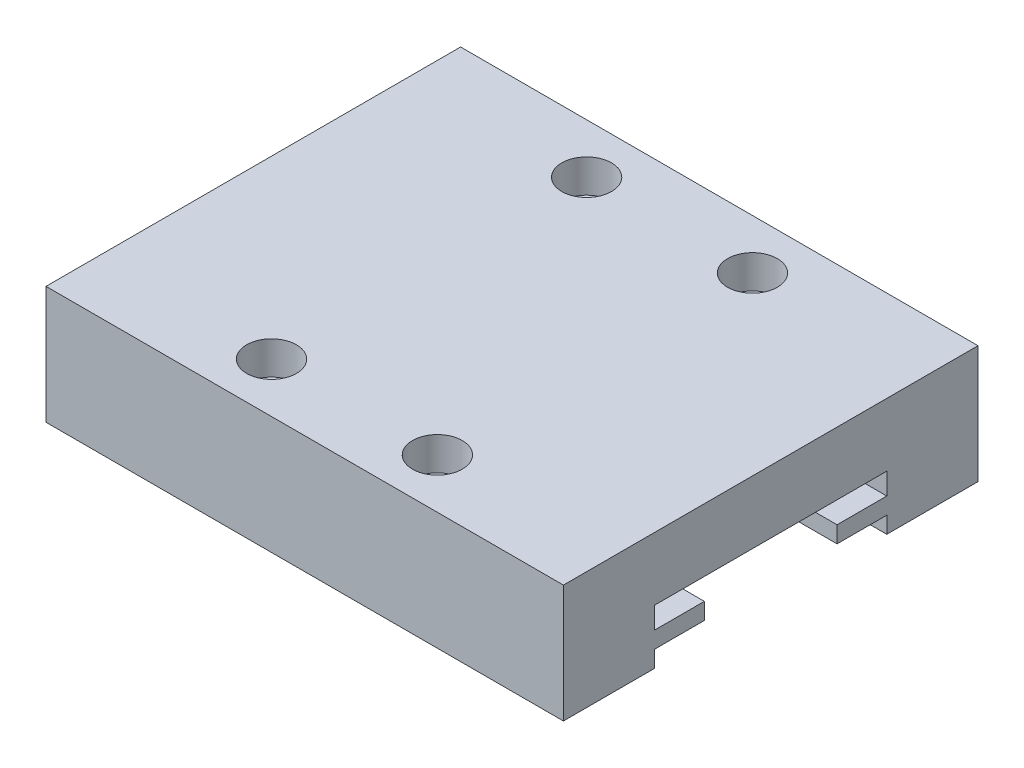
ISO-10303-21;
HEADER;
FILE_DESCRIPTION(('STEP AP214'),'2;1');
FILE_NAME('part.step','',(''),(''),'','','');
FILE_SCHEMA(('AUTOMOTIVE_DESIGN { 1 0 10303 214 1 1 1 1 }'));
ENDSEC;
DATA;
#1=APPLICATION_CONTEXT('core data for automotive mechanical design processes');
#2=APPLICATION_PROTOCOL_DEFINITION('international standard','automotive_design',2000,#1);
#3=PRODUCT_CONTEXT('',#1,'mechanical');
#4=PRODUCT('Part','Part','',(#3));
#5=PRODUCT_RELATED_PRODUCT_CATEGORY('part','',(#4));
#6=PRODUCT_DEFINITION_FORMATION('','',#4);
#7=PRODUCT_DEFINITION_CONTEXT('part definition',#1,'design');
#8=PRODUCT_DEFINITION('design','',#6,#7);
#9=PRODUCT_DEFINITION_SHAPE('','',#8);
#10=(LENGTH_UNIT() NAMED_UNIT(*) SI_UNIT(.MILLI.,.METRE.));
#11=(NAMED_UNIT(*) PLANE_ANGLE_UNIT() SI_UNIT($,.RADIAN.));
#12=(NAMED_UNIT(*) SI_UNIT($,.STERADIAN.) SOLID_ANGLE_UNIT());
#13=UNCERTAINTY_MEASURE_WITH_UNIT(LENGTH_MEASURE(1.E-05),#10,'distance_accuracy_value','');
#14=(GEOMETRIC_REPRESENTATION_CONTEXT(3) GLOBAL_UNCERTAINTY_ASSIGNED_CONTEXT((#13)) GLOBAL_UNIT_ASSIGNED_CONTEXT((#10,
#11,#12)) REPRESENTATION_CONTEXT('',''));
#15=CARTESIAN_POINT('',(0.,0.,0.));
#16=DIRECTION('',(0.,0.,1.));
#17=DIRECTION('',(1.,0.,0.));
#18=AXIS2_PLACEMENT_3D('',#15,#16,#17);
#19=CARTESIAN_POINT('',(0.,0.,0.));
#20=DIRECTION('',(0.,-1.,0.));
#21=DIRECTION('',(0.,0.,-1.));
#22=AXIS2_PLACEMENT_3D('',#19,#20,#21);
#23=PLANE('',#22);
#24=DIRECTION('',(1.,0.,0.));
#25=VECTOR('',#24,1.);
#26=CARTESIAN_POINT('',(0.,0.,-19.5));
#27=LINE('',#26,#25);
#28=CARTESIAN_POINT('',(0.,0.,-19.5));
#29=VERTEX_POINT('',#28);
#30=CARTESIAN_POINT('',(31.2,0.,-19.5));
#31=VERTEX_POINT('',#30);
#32=EDGE_CURVE('E166',#29,#31,#27,.T.);
#33=ORIENTED_EDGE('',*,*,#32,.F.);
#34=DIRECTION('',(0.,0.,1.));
#35=VECTOR('',#34,1.);
#36=CARTESIAN_POINT('',(0.,0.,0.));
#37=LINE('',#36,#35);
#38=CARTESIAN_POINT('',(0.,0.,-25.));
#39=VERTEX_POINT('',#38);
#40=EDGE_CURVE('E181',#39,#29,#37,.T.);
#41=ORIENTED_EDGE('',*,*,#40,.F.);
#42=DIRECTION('',(-1.,0.,0.));
#43=VECTOR('',#42,1.);
#44=CARTESIAN_POINT('',(0.,0.,-25.));
#45=LINE('',#44,#43);
#46=CARTESIAN_POINT('',(31.2,0.,-25.));
#47=VERTEX_POINT('',#46);
#48=EDGE_CURVE('E80',#47,#39,#45,.T.);
#49=ORIENTED_EDGE('',*,*,#48,.F.);
#50=DIRECTION('',(0.,0.,-1.));
#51=VECTOR('',#50,1.);
#52=CARTESIAN_POINT('',(31.2,0.,0.));
#53=LINE('',#52,#51);
#54=EDGE_CURVE('E190',#31,#47,#53,.T.);
#55=ORIENTED_EDGE('',*,*,#54,.F.);
#56=EDGE_LOOP('',(#33,#41,#49,#55));
#57=FACE_BOUND('',#56,.T.);
#58=ADVANCED_FACE('F35',(#57),#23,.T.);
#59=CARTESIAN_POINT('',(0.,7.1,0.));
#60=DIRECTION('',(1.,0.,0.));
#61=DIRECTION('',(0.,0.,-1.));
#62=AXIS2_PLACEMENT_3D('',#59,#60,#61);
#63=PLANE('',#62);
#64=ORIENTED_EDGE('',*,*,#40,.T.);
#65=DIRECTION('',(0.,-1.,0.));
#66=VECTOR('',#65,1.);
#67=CARTESIAN_POINT('',(0.,0.,-19.5));
#68=LINE('',#67,#66);
#69=CARTESIAN_POINT('',(0.,1.,-19.5));
#70=VERTEX_POINT('',#69);
#71=EDGE_CURVE('E260',#70,#29,#68,.T.);
#72=ORIENTED_EDGE('',*,*,#71,.F.);
#73=DIRECTION('',(0.,0.,-1.));
#74=VECTOR('',#73,1.);
#75=CARTESIAN_POINT('',(0.,1.,-19.5));
#76=LINE('',#75,#74);
#77=CARTESIAN_POINT('',(0.,1.,-16.5));
#78=VERTEX_POINT('',#77);
#79=EDGE_CURVE('E307',#78,#70,#76,.T.);
#80=ORIENTED_EDGE('',*,*,#79,.F.);
#81=DIRECTION('',(0.,-1.,0.));
#82=VECTOR('',#81,1.);
#83=CARTESIAN_POINT('',(0.,1.,-16.5));
#84=LINE('',#83,#82);
#85=CARTESIAN_POINT('',(0.,2.,-16.5));
#86=VERTEX_POINT('',#85);
#87=EDGE_CURVE('E305',#86,#78,#84,.T.);
#88=ORIENTED_EDGE('',*,*,#87,.F.);
#89=DIRECTION('',(0.,0.,1.));
#90=VECTOR('',#89,1.);
#91=CARTESIAN_POINT('',(0.,2.,-16.5));
#92=LINE('',#91,#90);
#93=CARTESIAN_POINT('',(0.,2.,-19.5));
#94=VERTEX_POINT('',#93);
#95=EDGE_CURVE('E239',#94,#86,#92,.T.);
#96=ORIENTED_EDGE('',*,*,#95,.F.);
#97=DIRECTION('',(0.,-1.,0.));
#98=VECTOR('',#97,1.);
#99=CARTESIAN_POINT('',(0.,2.,-19.5));
#100=LINE('',#99,#98);
#101=CARTESIAN_POINT('',(0.,3.3,-19.5));
#102=VERTEX_POINT('',#101);
#103=EDGE_CURVE('E302',#102,#94,#100,.T.);
#104=ORIENTED_EDGE('',*,*,#103,.F.);
#105=DIRECTION('',(0.,0.,-1.));
#106=VECTOR('',#105,1.);
#107=CARTESIAN_POINT('',(0.,3.3,-19.5));
#108=LINE('',#107,#106);
#109=CARTESIAN_POINT('',(0.,3.3,-5.50000000000001));
#110=VERTEX_POINT('',#109);
#111=EDGE_CURVE('E297',#110,#102,#108,.T.);
#112=ORIENTED_EDGE('',*,*,#111,.F.);
#113=DIRECTION('',(0.,1.,0.));
#114=VECTOR('',#113,1.);
#115=CARTESIAN_POINT('',(0.,2.,-5.5));
#116=LINE('',#115,#114);
#117=CARTESIAN_POINT('',(0.,2.,-5.5));
#118=VERTEX_POINT('',#117);
#119=EDGE_CURVE('E291',#118,#110,#116,.T.);
#120=ORIENTED_EDGE('',*,*,#119,.F.);
#121=DIRECTION('',(0.,0.,1.));
#122=VECTOR('',#121,1.);
#123=CARTESIAN_POINT('',(0.,2.,-8.5));
#124=LINE('',#123,#122);
#125=CARTESIAN_POINT('',(0.,2.,-8.5));
#126=VERTEX_POINT('',#125);
#127=EDGE_CURVE('E285',#126,#118,#124,.T.);
#128=ORIENTED_EDGE('',*,*,#127,.F.);
#129=DIRECTION('',(0.,1.,0.));
#130=VECTOR('',#129,1.);
#131=CARTESIAN_POINT('',(0.,1.,-8.5));
#132=LINE('',#131,#130);
#133=CARTESIAN_POINT('',(0.,1.,-8.5));
#134=VERTEX_POINT('',#133);
#135=EDGE_CURVE('E279',#134,#126,#132,.T.);
#136=ORIENTED_EDGE('',*,*,#135,.F.);
#137=DIRECTION('',(0.,0.,-1.));
#138=VECTOR('',#137,1.);
#139=CARTESIAN_POINT('',(0.,1.,-5.5));
#140=LINE('',#139,#138);
#141=CARTESIAN_POINT('',(0.,1.,-5.5));
#142=VERTEX_POINT('',#141);
#143=EDGE_CURVE('E176',#142,#134,#140,.T.);
#144=ORIENTED_EDGE('',*,*,#143,.F.);
#145=DIRECTION('',(0.,1.,0.));
#146=VECTOR('',#145,1.);
#147=CARTESIAN_POINT('',(0.,0.,-5.5));
#148=LINE('',#147,#146);
#149=CARTESIAN_POINT('',(0.,0.,-5.5));
#150=VERTEX_POINT('',#149);
#151=EDGE_CURVE('E160',#150,#142,#148,.T.);
#152=ORIENTED_EDGE('',*,*,#151,.F.);
#153=CARTESIAN_POINT('',(0.,0.,0.));
#154=VERTEX_POINT('',#153);
#155=EDGE_CURVE('E172',#150,#154,#37,.T.);
#156=ORIENTED_EDGE('',*,*,#155,.T.);
#157=DIRECTION('',(0.,-1.,0.));
#158=VECTOR('',#157,1.);
#159=CARTESIAN_POINT('',(0.,7.1,0.));
#160=LINE('',#159,#158);
#161=CARTESIAN_POINT('',(0.,7.1,0.));
#162=VERTEX_POINT('',#161);
#163=EDGE_CURVE('E167',#162,#154,#160,.T.);
#164=ORIENTED_EDGE('',*,*,#163,.F.);
#165=DIRECTION('',(0.,0.,1.));
#166=VECTOR('',#165,1.);
#167=CARTESIAN_POINT('',(0.,7.1,0.));
#168=LINE('',#167,#166);
#169=CARTESIAN_POINT('',(0.,7.1,-25.));
#170=VERTEX_POINT('',#169);
#171=EDGE_CURVE('E194',#170,#162,#168,.T.);
#172=ORIENTED_EDGE('',*,*,#171,.F.);
#173=DIRECTION('',(0.,-1.,0.));
#174=VECTOR('',#173,1.);
#175=CARTESIAN_POINT('',(0.,7.1,-25.));
#176=LINE('',#175,#174);
#177=EDGE_CURVE('E195',#170,#39,#176,.T.);
#178=ORIENTED_EDGE('',*,*,#177,.T.);
#179=EDGE_LOOP('',(#64,#72,#80,#88,#96,#104,#112,#120,#128,#136,#144,#152,#156,#164,#172,#178));
#180=FACE_BOUND('',#179,.T.);
#181=ADVANCED_FACE('F37',(#180),#63,.F.);
#182=CARTESIAN_POINT('',(0.,7.1,0.));
#183=DIRECTION('',(0.,0.,-1.));
#184=DIRECTION('',(-1.,0.,0.));
#185=AXIS2_PLACEMENT_3D('',#182,#183,#184);
#186=PLANE('',#185);
#187=DIRECTION('',(1.,0.,0.));
#188=VECTOR('',#187,1.);
#189=CARTESIAN_POINT('',(0.,0.,0.));
#190=LINE('',#189,#188);
#191=CARTESIAN_POINT('',(31.2,0.,0.));
#192=VERTEX_POINT('',#191);
#193=EDGE_CURVE('E180',#154,#192,#190,.T.);
#194=ORIENTED_EDGE('',*,*,#193,.T.);
#195=DIRECTION('',(0.,-1.,0.));
#196=VECTOR('',#195,1.);
#197=CARTESIAN_POINT('',(31.2,7.1,0.));
#198=LINE('',#197,#196);
#199=CARTESIAN_POINT('',(31.2,7.1,0.));
#200=VERTEX_POINT('',#199);
#201=EDGE_CURVE('E199',#200,#192,#198,.T.);
#202=ORIENTED_EDGE('',*,*,#201,.F.);
#203=DIRECTION('',(1.,0.,0.));
#204=VECTOR('',#203,1.);
#205=CARTESIAN_POINT('',(0.,7.1,0.));
#206=LINE('',#205,#204);
#207=EDGE_CURVE('E88',#162,#200,#206,.T.);
#208=ORIENTED_EDGE('',*,*,#207,.F.);
#209=ORIENTED_EDGE('',*,*,#163,.T.);
#210=EDGE_LOOP('',(#194,#202,#208,#209));
#211=FACE_BOUND('',#210,.T.);
#212=ADVANCED_FACE('F271',(#211),#186,.F.);
#213=CARTESIAN_POINT('',(31.2,7.1,0.));
#214=DIRECTION('',(-1.,0.,0.));
#215=DIRECTION('',(0.,0.,1.));
#216=AXIS2_PLACEMENT_3D('',#213,#214,#215);
#217=PLANE('',#216);
#218=DIRECTION('',(0.,0.,-1.));
#219=VECTOR('',#218,1.);
#220=CARTESIAN_POINT('',(31.2,1.,0.));
#221=LINE('',#220,#219);
#222=CARTESIAN_POINT('',(31.2,1.,-16.5));
#223=VERTEX_POINT('',#222);
#224=CARTESIAN_POINT('',(31.2,1.,-19.5));
#225=VERTEX_POINT('',#224);
#226=EDGE_CURVE('E11',#223,#225,#221,.T.);
#227=ORIENTED_EDGE('',*,*,#226,.T.);
#228=DIRECTION('',(0.,-1.,0.));
#229=VECTOR('',#228,1.);
#230=CARTESIAN_POINT('',(31.2,7.1,-19.5));
#231=LINE('',#230,#229);
#232=EDGE_CURVE('E182',#225,#31,#231,.T.);
#233=ORIENTED_EDGE('',*,*,#232,.T.);
#234=ORIENTED_EDGE('',*,*,#54,.T.);
#235=DIRECTION('',(0.,-1.,0.));
#236=VECTOR('',#235,1.);
#237=CARTESIAN_POINT('',(31.2,7.1,-25.));
#238=LINE('',#237,#236);
#239=CARTESIAN_POINT('',(31.2,7.1,-25.));
#240=VERTEX_POINT('',#239);
#241=EDGE_CURVE('E197',#240,#47,#238,.T.);
#242=ORIENTED_EDGE('',*,*,#241,.F.);
#243=DIRECTION('',(0.,0.,-1.));
#244=VECTOR('',#243,1.);
#245=CARTESIAN_POINT('',(31.2,7.1,0.));
#246=LINE('',#245,#244);
#247=EDGE_CURVE('E263',#200,#240,#246,.T.);
#248=ORIENTED_EDGE('',*,*,#247,.F.);
#249=ORIENTED_EDGE('',*,*,#201,.T.);
#250=CARTESIAN_POINT('',(31.2,0.,-5.5));
#251=VERTEX_POINT('',#250);
#252=EDGE_CURVE('E191',#192,#251,#53,.T.);
#253=ORIENTED_EDGE('',*,*,#252,.T.);
#254=DIRECTION('',(0.,1.,0.));
#255=VECTOR('',#254,1.);
#256=CARTESIAN_POINT('',(31.2,7.1,-5.5));
#257=LINE('',#256,#255);
#258=CARTESIAN_POINT('',(31.2,1.,-5.5));
#259=VERTEX_POINT('',#258);
#260=EDGE_CURVE('E50',#251,#259,#257,.T.);
#261=ORIENTED_EDGE('',*,*,#260,.T.);
#262=DIRECTION('',(0.,0.,-1.));
#263=VECTOR('',#262,1.);
#264=CARTESIAN_POINT('',(31.2,1.,0.));
#265=LINE('',#264,#263);
#266=CARTESIAN_POINT('',(31.2,1.,-8.5));
#267=VERTEX_POINT('',#266);
#268=EDGE_CURVE('E204',#259,#267,#265,.T.);
#269=ORIENTED_EDGE('',*,*,#268,.T.);
#270=DIRECTION('',(0.,1.,0.));
#271=VECTOR('',#270,1.);
#272=CARTESIAN_POINT('',(31.2,7.1,-8.5));
#273=LINE('',#272,#271);
#274=CARTESIAN_POINT('',(31.2,2.,-8.5));
#275=VERTEX_POINT('',#274);
#276=EDGE_CURVE('E207',#267,#275,#273,.T.);
#277=ORIENTED_EDGE('',*,*,#276,.T.);
#278=DIRECTION('',(0.,0.,1.));
#279=VECTOR('',#278,1.);
#280=CARTESIAN_POINT('',(31.2,2.,0.));
#281=LINE('',#280,#279);
#282=CARTESIAN_POINT('',(31.2,2.,-5.5));
#283=VERTEX_POINT('',#282);
#284=EDGE_CURVE('E210',#275,#283,#281,.T.);
#285=ORIENTED_EDGE('',*,*,#284,.T.);
#286=DIRECTION('',(0.,1.,0.));
#287=VECTOR('',#286,1.);
#288=CARTESIAN_POINT('',(31.2,7.09999999999998,-5.50000000000002));
#289=LINE('',#288,#287);
#290=CARTESIAN_POINT('',(31.2,3.3,-5.50000000000001));
#291=VERTEX_POINT('',#290);
#292=EDGE_CURVE('E213',#283,#291,#289,.T.);
#293=ORIENTED_EDGE('',*,*,#292,.T.);
#294=DIRECTION('',(0.,0.,-1.));
#295=VECTOR('',#294,1.);
#296=CARTESIAN_POINT('',(31.2,3.3,0.));
#297=LINE('',#296,#295);
#298=CARTESIAN_POINT('',(31.2,3.3,-19.5));
#299=VERTEX_POINT('',#298);
#300=EDGE_CURVE('E216',#291,#299,#297,.T.);
#301=ORIENTED_EDGE('',*,*,#300,.T.);
#302=DIRECTION('',(0.,-1.,0.));
#303=VECTOR('',#302,1.);
#304=CARTESIAN_POINT('',(31.2,7.10000000000005,-19.5));
#305=LINE('',#304,#303);
#306=CARTESIAN_POINT('',(31.2,2.,-19.5));
#307=VERTEX_POINT('',#306);
#308=EDGE_CURVE('E219',#299,#307,#305,.T.);
#309=ORIENTED_EDGE('',*,*,#308,.T.);
#310=DIRECTION('',(0.,0.,1.));
#311=VECTOR('',#310,1.);
#312=CARTESIAN_POINT('',(31.2,2.,0.));
#313=LINE('',#312,#311);
#314=CARTESIAN_POINT('',(31.2,2.,-16.5));
#315=VERTEX_POINT('',#314);
#316=EDGE_CURVE('E222',#307,#315,#313,.T.);
#317=ORIENTED_EDGE('',*,*,#316,.T.);
#318=DIRECTION('',(0.,-1.,0.));
#319=VECTOR('',#318,1.);
#320=CARTESIAN_POINT('',(31.2,7.1,-16.5));
#321=LINE('',#320,#319);
#322=EDGE_CURVE('E43',#315,#223,#321,.T.);
#323=ORIENTED_EDGE('',*,*,#322,.T.);
#324=EDGE_LOOP('',(#227,#233,#234,#242,#248,#249,#253,#261,#269,#277,#285,#293,#301,#309,#317,#323));
#325=FACE_BOUND('',#324,.T.);
#326=ADVANCED_FACE('F226',(#325),#217,.F.);
#327=CARTESIAN_POINT('',(0.,7.1,-25.));
#328=DIRECTION('',(0.,0.,1.));
#329=DIRECTION('',(1.,0.,0.));
#330=AXIS2_PLACEMENT_3D('',#327,#328,#329);
#331=PLANE('',#330);
#332=ORIENTED_EDGE('',*,*,#48,.T.);
#333=ORIENTED_EDGE('',*,*,#177,.F.);
#334=DIRECTION('',(-1.,0.,0.));
#335=VECTOR('',#334,1.);
#336=CARTESIAN_POINT('',(0.,7.1,-25.));
#337=LINE('',#336,#335);
#338=EDGE_CURVE('E59',#240,#170,#337,.T.);
#339=ORIENTED_EDGE('',*,*,#338,.F.);
#340=ORIENTED_EDGE('',*,*,#241,.T.);
#341=EDGE_LOOP('',(#332,#333,#339,#340));
#342=FACE_BOUND('',#341,.T.);
#343=ADVANCED_FACE('F268',(#342),#331,.F.);
#344=CARTESIAN_POINT('',(0.,7.1,0.));
#345=DIRECTION('',(0.,-1.,0.));
#346=DIRECTION('',(0.,0.,-1.));
#347=AXIS2_PLACEMENT_3D('',#344,#345,#346);
#348=PLANE('',#347);
#349=CARTESIAN_POINT('',(10.6,7.1,-3.));
#350=DIRECTION('',(0.,1.,0.));
#351=DIRECTION('',(0.,0.,-1.));
#352=AXIS2_PLACEMENT_3D('',#349,#350,#351);
#353=CIRCLE('',#352,1.5);
#354=CARTESIAN_POINT('',(10.6,7.1,-4.5));
#355=VERTEX_POINT('',#354);
#356=EDGE_CURVE('E414',#355,#355,#353,.T.);
#357=ORIENTED_EDGE('',*,*,#356,.F.);
#358=EDGE_LOOP('',(#357));
#359=FACE_BOUND('',#358,.T.);
#360=CARTESIAN_POINT('',(20.6,7.1,-3.));
#361=DIRECTION('',(0.,1.,0.));
#362=DIRECTION('',(0.,0.,1.));
#363=AXIS2_PLACEMENT_3D('',#360,#361,#362);
#364=CIRCLE('',#363,1.5);
#365=CARTESIAN_POINT('',(20.6,7.1,-1.5));
#366=VERTEX_POINT('',#365);
#367=EDGE_CURVE('E408',#366,#366,#364,.T.);
#368=ORIENTED_EDGE('',*,*,#367,.F.);
#369=EDGE_LOOP('',(#368));
#370=FACE_BOUND('',#369,.T.);
#371=CARTESIAN_POINT('',(20.6,7.1,-22.));
#372=DIRECTION('',(0.,1.,0.));
#373=DIRECTION('',(0.,0.,-1.));
#374=AXIS2_PLACEMENT_3D('',#371,#372,#373);
#375=CIRCLE('',#374,1.5);
#376=CARTESIAN_POINT('',(20.6,7.1,-23.5));
#377=VERTEX_POINT('',#376);
#378=EDGE_CURVE('E398',#377,#377,#375,.T.);
#379=ORIENTED_EDGE('',*,*,#378,.F.);
#380=EDGE_LOOP('',(#379));
#381=FACE_BOUND('',#380,.T.);
#382=CARTESIAN_POINT('',(10.6,7.1,-22.));
#383=DIRECTION('',(0.,1.,0.));
#384=DIRECTION('',(0.,0.,1.));
#385=AXIS2_PLACEMENT_3D('',#382,#383,#384);
#386=CIRCLE('',#385,1.5);
#387=CARTESIAN_POINT('',(10.6,7.1,-20.5));
#388=VERTEX_POINT('',#387);
#389=EDGE_CURVE('E397',#388,#388,#386,.T.);
#390=ORIENTED_EDGE('',*,*,#389,.F.);
#391=EDGE_LOOP('',(#390));
#392=FACE_BOUND('',#391,.T.);
#393=ORIENTED_EDGE('',*,*,#171,.T.);
#394=ORIENTED_EDGE('',*,*,#207,.T.);
#395=ORIENTED_EDGE('',*,*,#247,.T.);
#396=ORIENTED_EDGE('',*,*,#338,.T.);
#397=EDGE_LOOP('',(#393,#394,#395,#396));
#398=FACE_BOUND('',#397,.T.);
#399=ADVANCED_FACE('F266',(#359,#370,#381,#392,#398),#348,.F.);
#400=DIRECTION('',(-1.,0.,0.));
#401=VECTOR('',#400,1.);
#402=CARTESIAN_POINT('',(0.,0.,-5.5));
#403=LINE('',#402,#401);
#404=EDGE_CURVE('E157',#251,#150,#403,.T.);
#405=ORIENTED_EDGE('',*,*,#404,.F.);
#406=ORIENTED_EDGE('',*,*,#252,.F.);
#407=ORIENTED_EDGE('',*,*,#193,.F.);
#408=ORIENTED_EDGE('',*,*,#155,.F.);
#409=EDGE_LOOP('',(#405,#406,#407,#408));
#410=FACE_BOUND('',#409,.T.);
#411=ADVANCED_FACE('F179',(#410),#23,.T.);
#412=CARTESIAN_POINT('',(50.9,1.,-19.5));
#413=DIRECTION('',(0.,1.,0.));
#414=DIRECTION('',(0.,0.,1.));
#415=AXIS2_PLACEMENT_3D('',#412,#413,#414);
#416=PLANE('',#415);
#417=DIRECTION('',(-1.,0.,0.));
#418=VECTOR('',#417,1.);
#419=CARTESIAN_POINT('',(50.9,1.,-16.5));
#420=LINE('',#419,#418);
#421=EDGE_CURVE('E234',#223,#78,#420,.T.);
#422=ORIENTED_EDGE('',*,*,#421,.T.);
#423=ORIENTED_EDGE('',*,*,#79,.T.);
#424=DIRECTION('',(-1.,0.,0.));
#425=VECTOR('',#424,1.);
#426=CARTESIAN_POINT('',(50.9,1.,-19.5));
#427=LINE('',#426,#425);
#428=EDGE_CURVE('E243',#225,#70,#427,.T.);
#429=ORIENTED_EDGE('',*,*,#428,.F.);
#430=ORIENTED_EDGE('',*,*,#226,.F.);
#431=EDGE_LOOP('',(#422,#423,#429,#430));
#432=FACE_BOUND('',#431,.T.);
#433=ADVANCED_FACE('F319',(#432),#416,.F.);
#434=CARTESIAN_POINT('',(50.9,1.,-16.5));
#435=DIRECTION('',(0.,0.,-1.));
#436=DIRECTION('',(-1.,0.,0.));
#437=AXIS2_PLACEMENT_3D('',#434,#435,#436);
#438=PLANE('',#437);
#439=DIRECTION('',(-1.,0.,0.));
#440=VECTOR('',#439,1.);
#441=CARTESIAN_POINT('',(50.9,2.,-16.5));
#442=LINE('',#441,#440);
#443=EDGE_CURVE('E232',#315,#86,#442,.T.);
#444=ORIENTED_EDGE('',*,*,#443,.T.);
#445=ORIENTED_EDGE('',*,*,#87,.T.);
#446=ORIENTED_EDGE('',*,*,#421,.F.);
#447=ORIENTED_EDGE('',*,*,#322,.F.);
#448=EDGE_LOOP('',(#444,#445,#446,#447));
#449=FACE_BOUND('',#448,.T.);
#450=ADVANCED_FACE('F230',(#449),#438,.F.);
#451=CARTESIAN_POINT('',(50.9,2.,-16.5));
#452=DIRECTION('',(0.,-1.,0.));
#453=DIRECTION('',(0.,0.,-1.));
#454=AXIS2_PLACEMENT_3D('',#451,#452,#453);
#455=PLANE('',#454);
#456=DIRECTION('',(-1.,0.,0.));
#457=VECTOR('',#456,1.);
#458=CARTESIAN_POINT('',(50.9,2.,-19.5));
#459=LINE('',#458,#457);
#460=EDGE_CURVE('E241',#307,#94,#459,.T.);
#461=ORIENTED_EDGE('',*,*,#460,.T.);
#462=ORIENTED_EDGE('',*,*,#95,.T.);
#463=ORIENTED_EDGE('',*,*,#443,.F.);
#464=ORIENTED_EDGE('',*,*,#316,.F.);
#465=EDGE_LOOP('',(#461,#462,#463,#464));
#466=FACE_BOUND('',#465,.T.);
#467=ADVANCED_FACE('F236',(#466),#455,.F.);
#468=CARTESIAN_POINT('',(50.9,2.,-19.5));
#469=DIRECTION('',(0.,0.,-1.));
#470=DIRECTION('',(0.,1.,0.));
#471=AXIS2_PLACEMENT_3D('',#468,#469,#470);
#472=PLANE('',#471);
#473=DIRECTION('',(-1.,0.,0.));
#474=VECTOR('',#473,1.);
#475=CARTESIAN_POINT('',(50.9,3.3,-19.5));
#476=LINE('',#475,#474);
#477=EDGE_CURVE('E245',#299,#102,#476,.T.);
#478=ORIENTED_EDGE('',*,*,#477,.T.);
#479=ORIENTED_EDGE('',*,*,#103,.T.);
#480=ORIENTED_EDGE('',*,*,#460,.F.);
#481=ORIENTED_EDGE('',*,*,#308,.F.);
#482=EDGE_LOOP('',(#478,#479,#480,#481));
#483=FACE_BOUND('',#482,.T.);
#484=ADVANCED_FACE('F301',(#483),#472,.F.);
#485=CARTESIAN_POINT('',(50.9,3.3,-19.5));
#486=DIRECTION('',(0.,1.,0.));
#487=DIRECTION('',(0.,0.,1.));
#488=AXIS2_PLACEMENT_3D('',#485,#486,#487);
#489=PLANE('',#488);
#490=DIRECTION('',(-1.,0.,0.));
#491=VECTOR('',#490,1.);
#492=CARTESIAN_POINT('',(50.9,3.3,-5.50000000000001));
#493=LINE('',#492,#491);
#494=EDGE_CURVE('E250',#291,#110,#493,.T.);
#495=ORIENTED_EDGE('',*,*,#494,.T.);
#496=ORIENTED_EDGE('',*,*,#111,.T.);
#497=ORIENTED_EDGE('',*,*,#477,.F.);
#498=ORIENTED_EDGE('',*,*,#300,.F.);
#499=EDGE_LOOP('',(#495,#496,#497,#498));
#500=FACE_BOUND('',#499,.T.);
#501=ADVANCED_FACE('F295',(#500),#489,.F.);
#502=CARTESIAN_POINT('',(50.9,2.,-5.5));
#503=DIRECTION('',(0.,0.,1.));
#504=DIRECTION('',(0.,-1.,0.));
#505=AXIS2_PLACEMENT_3D('',#502,#503,#504);
#506=PLANE('',#505);
#507=DIRECTION('',(-1.,0.,0.));
#508=VECTOR('',#507,1.);
#509=CARTESIAN_POINT('',(50.9,2.,-5.5));
#510=LINE('',#509,#508);
#511=EDGE_CURVE('E252',#283,#118,#510,.T.);
#512=ORIENTED_EDGE('',*,*,#511,.T.);
#513=ORIENTED_EDGE('',*,*,#119,.T.);
#514=ORIENTED_EDGE('',*,*,#494,.F.);
#515=ORIENTED_EDGE('',*,*,#292,.F.);
#516=EDGE_LOOP('',(#512,#513,#514,#515));
#517=FACE_BOUND('',#516,.T.);
#518=ADVANCED_FACE('F289',(#517),#506,.F.);
#519=CARTESIAN_POINT('',(50.9,2.,-8.5));
#520=DIRECTION('',(0.,-1.,0.));
#521=DIRECTION('',(0.,0.,-1.));
#522=AXIS2_PLACEMENT_3D('',#519,#520,#521);
#523=PLANE('',#522);
#524=DIRECTION('',(-1.,0.,0.));
#525=VECTOR('',#524,1.);
#526=CARTESIAN_POINT('',(50.9,2.,-8.5));
#527=LINE('',#526,#525);
#528=EDGE_CURVE('E254',#275,#126,#527,.T.);
#529=ORIENTED_EDGE('',*,*,#528,.T.);
#530=ORIENTED_EDGE('',*,*,#127,.T.);
#531=ORIENTED_EDGE('',*,*,#511,.F.);
#532=ORIENTED_EDGE('',*,*,#284,.F.);
#533=EDGE_LOOP('',(#529,#530,#531,#532));
#534=FACE_BOUND('',#533,.T.);
#535=ADVANCED_FACE('F283',(#534),#523,.F.);
#536=CARTESIAN_POINT('',(50.9,1.,-8.5));
#537=DIRECTION('',(0.,0.,1.));
#538=DIRECTION('',(1.,0.,0.));
#539=AXIS2_PLACEMENT_3D('',#536,#537,#538);
#540=PLANE('',#539);
#541=DIRECTION('',(-1.,0.,0.));
#542=VECTOR('',#541,1.);
#543=CARTESIAN_POINT('',(50.9,1.,-8.5));
#544=LINE('',#543,#542);
#545=EDGE_CURVE('E256',#267,#134,#544,.T.);
#546=ORIENTED_EDGE('',*,*,#545,.T.);
#547=ORIENTED_EDGE('',*,*,#135,.T.);
#548=ORIENTED_EDGE('',*,*,#528,.F.);
#549=ORIENTED_EDGE('',*,*,#276,.F.);
#550=EDGE_LOOP('',(#546,#547,#548,#549));
#551=FACE_BOUND('',#550,.T.);
#552=ADVANCED_FACE('F277',(#551),#540,.F.);
#553=CARTESIAN_POINT('',(50.9,1.,-5.5));
#554=DIRECTION('',(0.,1.,0.));
#555=DIRECTION('',(0.,0.,1.));
#556=AXIS2_PLACEMENT_3D('',#553,#554,#555);
#557=PLANE('',#556);
#558=DIRECTION('',(-1.,0.,0.));
#559=VECTOR('',#558,1.);
#560=CARTESIAN_POINT('',(50.9,1.,-5.5));
#561=LINE('',#560,#559);
#562=EDGE_CURVE('E258',#259,#142,#561,.T.);
#563=ORIENTED_EDGE('',*,*,#562,.T.);
#564=ORIENTED_EDGE('',*,*,#143,.T.);
#565=ORIENTED_EDGE('',*,*,#545,.F.);
#566=ORIENTED_EDGE('',*,*,#268,.F.);
#567=EDGE_LOOP('',(#563,#564,#565,#566));
#568=FACE_BOUND('',#567,.T.);
#569=ADVANCED_FACE('F274',(#568),#557,.F.);
#570=CARTESIAN_POINT('',(50.9,0.,-19.5));
#571=DIRECTION('',(0.,0.,-1.));
#572=DIRECTION('',(-1.,0.,0.));
#573=AXIS2_PLACEMENT_3D('',#570,#571,#572);
#574=PLANE('',#573);
#575=ORIENTED_EDGE('',*,*,#428,.T.);
#576=ORIENTED_EDGE('',*,*,#71,.T.);
#577=ORIENTED_EDGE('',*,*,#32,.T.);
#578=ORIENTED_EDGE('',*,*,#232,.F.);
#579=EDGE_LOOP('',(#575,#576,#577,#578));
#580=FACE_BOUND('',#579,.T.);
#581=ADVANCED_FACE('F315',(#580),#574,.F.);
#582=CARTESIAN_POINT('',(50.9,0.,-5.5));
#583=DIRECTION('',(0.,0.,1.));
#584=DIRECTION('',(1.,0.,0.));
#585=AXIS2_PLACEMENT_3D('',#582,#583,#584);
#586=PLANE('',#585);
#587=ORIENTED_EDGE('',*,*,#404,.T.);
#588=ORIENTED_EDGE('',*,*,#151,.T.);
#589=ORIENTED_EDGE('',*,*,#562,.F.);
#590=ORIENTED_EDGE('',*,*,#260,.F.);
#591=EDGE_LOOP('',(#587,#588,#589,#590));
#592=FACE_BOUND('',#591,.T.);
#593=ADVANCED_FACE('F159',(#592),#586,.F.);
#594=CARTESIAN_POINT('',(10.6,5.1,-22.));
#595=DIRECTION('',(0.,1.,0.));
#596=DIRECTION('',(0.,0.,1.));
#597=AXIS2_PLACEMENT_3D('',#594,#595,#596);
#598=CYLINDRICAL_SURFACE('',#597,1.5);
#599=CARTESIAN_POINT('',(10.6,5.1,-22.));
#600=DIRECTION('',(0.,1.,0.));
#601=DIRECTION('',(0.,0.,1.));
#602=AXIS2_PLACEMENT_3D('',#599,#600,#601);
#603=CIRCLE('',#602,1.5);
#604=CARTESIAN_POINT('',(10.6,5.1,-20.5));
#605=VERTEX_POINT('',#604);
#606=EDGE_CURVE('E177',#605,#605,#603,.T.);
#607=ORIENTED_EDGE('',*,*,#606,.F.);
#608=EDGE_LOOP('',(#607));
#609=FACE_BOUND('',#608,.T.);
#610=ORIENTED_EDGE('',*,*,#389,.T.);
#611=EDGE_LOOP('',(#610));
#612=FACE_BOUND('',#611,.T.);
#613=ADVANCED_FACE('F343',(#609,#612),#598,.F.);
#614=CARTESIAN_POINT('',(10.6,5.1,-22.));
#615=DIRECTION('',(0.,1.,0.));
#616=DIRECTION('',(0.,0.,1.));
#617=AXIS2_PLACEMENT_3D('',#614,#615,#616);
#618=PLANE('',#617);
#619=ORIENTED_EDGE('',*,*,#606,.T.);
#620=EDGE_LOOP('',(#619));
#621=FACE_BOUND('',#620,.T.);
#622=ADVANCED_FACE('F364',(#621),#618,.T.);
#623=CARTESIAN_POINT('',(20.6,5.1,-22.));
#624=DIRECTION('',(0.,1.,0.));
#625=DIRECTION('',(0.,0.,1.));
#626=AXIS2_PLACEMENT_3D('',#623,#624,#625);
#627=CYLINDRICAL_SURFACE('',#626,1.5);
#628=CARTESIAN_POINT('',(20.6,5.1,-22.));
#629=DIRECTION('',(0.,1.,0.));
#630=DIRECTION('',(0.,0.,-1.));
#631=AXIS2_PLACEMENT_3D('',#628,#629,#630);
#632=CIRCLE('',#631,1.5);
#633=CARTESIAN_POINT('',(20.6,5.1,-23.5));
#634=VERTEX_POINT('',#633);
#635=EDGE_CURVE('E396',#634,#634,#632,.T.);
#636=ORIENTED_EDGE('',*,*,#635,.F.);
#637=EDGE_LOOP('',(#636));
#638=FACE_BOUND('',#637,.T.);
#639=ORIENTED_EDGE('',*,*,#378,.T.);
#640=EDGE_LOOP('',(#639));
#641=FACE_BOUND('',#640,.T.);
#642=ADVANCED_FACE('F368',(#638,#641),#627,.F.);
#643=CARTESIAN_POINT('',(20.6,5.1,-22.));
#644=DIRECTION('',(0.,-1.,0.));
#645=DIRECTION('',(0.,0.,-1.));
#646=AXIS2_PLACEMENT_3D('',#643,#644,#645);
#647=PLANE('',#646);
#648=ORIENTED_EDGE('',*,*,#635,.T.);
#649=EDGE_LOOP('',(#648));
#650=FACE_BOUND('',#649,.T.);
#651=ADVANCED_FACE('F382',(#650),#647,.F.);
#652=CARTESIAN_POINT('',(20.6,5.1,-3.));
#653=DIRECTION('',(0.,1.,0.));
#654=DIRECTION('',(0.,0.,1.));
#655=AXIS2_PLACEMENT_3D('',#652,#653,#654);
#656=CYLINDRICAL_SURFACE('',#655,1.5);
#657=CARTESIAN_POINT('',(20.6,5.1,-3.));
#658=DIRECTION('',(0.,1.,0.));
#659=DIRECTION('',(0.,0.,1.));
#660=AXIS2_PLACEMENT_3D('',#657,#658,#659);
#661=CIRCLE('',#660,1.5);
#662=CARTESIAN_POINT('',(20.6,5.1,-1.5));
#663=VERTEX_POINT('',#662);
#664=EDGE_CURVE('E403',#663,#663,#661,.T.);
#665=ORIENTED_EDGE('',*,*,#664,.F.);
#666=EDGE_LOOP('',(#665));
#667=FACE_BOUND('',#666,.T.);
#668=ORIENTED_EDGE('',*,*,#367,.T.);
#669=EDGE_LOOP('',(#668));
#670=FACE_BOUND('',#669,.T.);
#671=ADVANCED_FACE('F379',(#667,#670),#656,.F.);
#672=CARTESIAN_POINT('',(20.6,5.1,-3.));
#673=DIRECTION('',(0.,1.,0.));
#674=DIRECTION('',(0.,0.,1.));
#675=AXIS2_PLACEMENT_3D('',#672,#673,#674);
#676=PLANE('',#675);
#677=ORIENTED_EDGE('',*,*,#664,.T.);
#678=EDGE_LOOP('',(#677));
#679=FACE_BOUND('',#678,.T.);
#680=ADVANCED_FACE('F374',(#679),#676,.T.);
#681=CARTESIAN_POINT('',(10.6,5.1,-3.));
#682=DIRECTION('',(0.,1.,0.));
#683=DIRECTION('',(0.,0.,1.));
#684=AXIS2_PLACEMENT_3D('',#681,#682,#683);
#685=CYLINDRICAL_SURFACE('',#684,1.5);
#686=CARTESIAN_POINT('',(10.6,5.1,-3.));
#687=DIRECTION('',(0.,1.,0.));
#688=DIRECTION('',(0.,0.,-1.));
#689=AXIS2_PLACEMENT_3D('',#686,#687,#688);
#690=CIRCLE('',#689,1.5);
#691=CARTESIAN_POINT('',(10.6,5.1,-4.5));
#692=VERTEX_POINT('',#691);
#693=EDGE_CURVE('E411',#692,#692,#690,.T.);
#694=ORIENTED_EDGE('',*,*,#693,.F.);
#695=EDGE_LOOP('',(#694));
#696=FACE_BOUND('',#695,.T.);
#697=ORIENTED_EDGE('',*,*,#356,.T.);
#698=EDGE_LOOP('',(#697));
#699=FACE_BOUND('',#698,.T.);
#700=ADVANCED_FACE('F370',(#696,#699),#685,.F.);
#701=CARTESIAN_POINT('',(10.6,5.1,-3.));
#702=DIRECTION('',(0.,-1.,0.));
#703=DIRECTION('',(0.,0.,-1.));
#704=AXIS2_PLACEMENT_3D('',#701,#702,#703);
#705=PLANE('',#704);
#706=ORIENTED_EDGE('',*,*,#693,.T.);
#707=EDGE_LOOP('',(#706));
#708=FACE_BOUND('',#707,.T.);
#709=ADVANCED_FACE('F373',(#708),#705,.F.);
#710=CLOSED_SHELL('',(#58,#181,#212,#326,#343,#399,#411,#433,#450,#467,#484,#501,#518,#535,#552,
#569,#581,#593,#613,#622,#642,#651,#671,#680,#700,#709));
#711=MANIFOLD_SOLID_BREP('B2',#710);
#712=ADVANCED_BREP_SHAPE_REPRESENTATION('',(#18,#711),#14);
#713=SHAPE_DEFINITION_REPRESENTATION(#9,#712);
ENDSEC;
END-ISO-10303-21;
